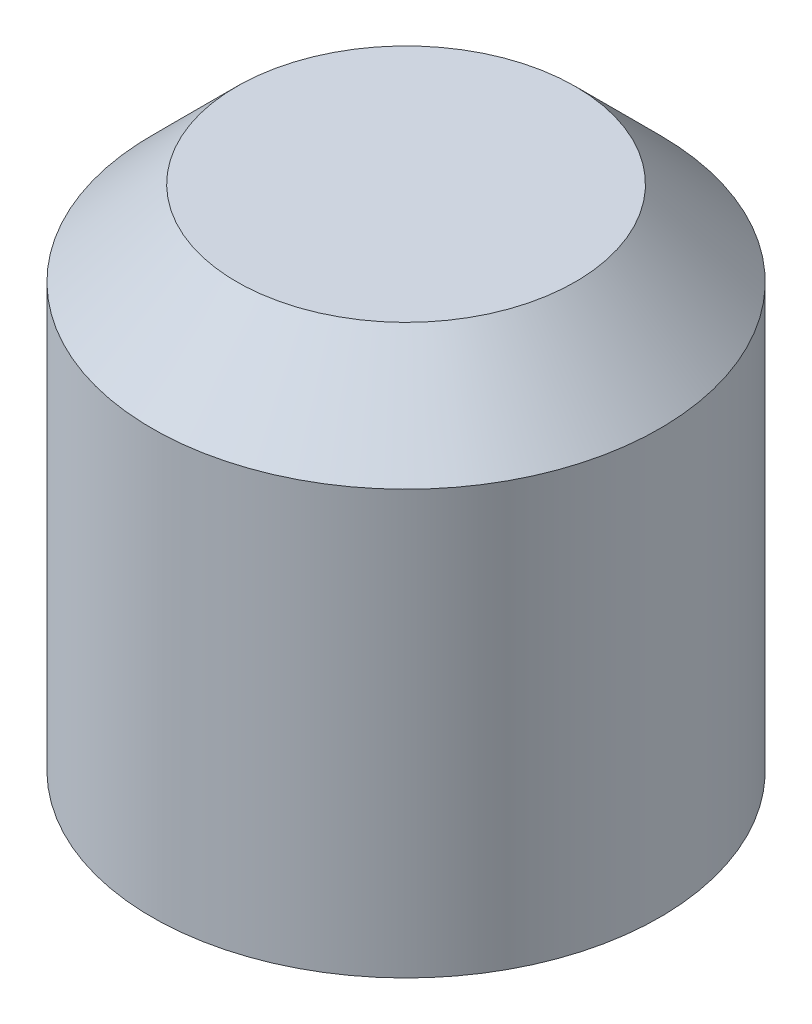
ISO-10303-21;
HEADER;
FILE_DESCRIPTION(('STEP AP214'),'2;1');
FILE_NAME('part.step','',(''),(''),'','','');
FILE_SCHEMA(('AUTOMOTIVE_DESIGN { 1 0 10303 214 1 1 1 1 }'));
ENDSEC;
DATA;
#1=APPLICATION_CONTEXT('core data for automotive mechanical design processes');
#2=APPLICATION_PROTOCOL_DEFINITION('international standard','automotive_design',2000,#1);
#3=PRODUCT_CONTEXT('',#1,'mechanical');
#4=PRODUCT('Part','Part','',(#3));
#5=PRODUCT_RELATED_PRODUCT_CATEGORY('part','',(#4));
#6=PRODUCT_DEFINITION_FORMATION('','',#4);
#7=PRODUCT_DEFINITION_CONTEXT('part definition',#1,'design');
#8=PRODUCT_DEFINITION('design','',#6,#7);
#9=PRODUCT_DEFINITION_SHAPE('','',#8);
#10=(LENGTH_UNIT() NAMED_UNIT(*) SI_UNIT(.MILLI.,.METRE.));
#11=(NAMED_UNIT(*) PLANE_ANGLE_UNIT() SI_UNIT($,.RADIAN.));
#12=(NAMED_UNIT(*) SI_UNIT($,.STERADIAN.) SOLID_ANGLE_UNIT());
#13=UNCERTAINTY_MEASURE_WITH_UNIT(LENGTH_MEASURE(1.E-05),#10,'distance_accuracy_value','');
#14=(GEOMETRIC_REPRESENTATION_CONTEXT(3) GLOBAL_UNCERTAINTY_ASSIGNED_CONTEXT((#13)) GLOBAL_UNIT_ASSIGNED_CONTEXT((#10,
#11,#12)) REPRESENTATION_CONTEXT('',''));
#15=CARTESIAN_POINT('',(0.,0.,0.));
#16=DIRECTION('',(0.,0.,1.));
#17=DIRECTION('',(1.,0.,0.));
#18=AXIS2_PLACEMENT_3D('',#15,#16,#17);
#19=CARTESIAN_POINT('',(-1.15470053837925,2.,0.));
#20=DIRECTION('',(-0.866025403784439,0.,-0.5));
#21=DIRECTION('',(-0.5,0.,0.866025403784439));
#22=AXIS2_PLACEMENT_3D('',#19,#20,#21);
#23=PLANE('',#22);
#24=DIRECTION('',(0.,1.,0.));
#25=VECTOR('',#24,1.);
#26=CARTESIAN_POINT('',(-0.577350269189626,2.,-1.));
#27=LINE('',#26,#25);
#28=CARTESIAN_POINT('',(-0.577350269189626,0.,-1.));
#29=VERTEX_POINT('',#28);
#30=CARTESIAN_POINT('',(-0.577350269189626,2.,-1.));
#31=VERTEX_POINT('',#30);
#32=EDGE_CURVE('E81',#29,#31,#27,.T.);
#33=ORIENTED_EDGE('',*,*,#32,.T.);
#34=DIRECTION('',(-0.5,0.,0.866025403784439));
#35=VECTOR('',#34,1.);
#36=CARTESIAN_POINT('',(-1.15470053837925,2.,0.));
#37=LINE('',#36,#35);
#38=CARTESIAN_POINT('',(-1.15470053837925,2.,0.));
#39=VERTEX_POINT('',#38);
#40=EDGE_CURVE('E70',#39,#31,#37,.F.);
#41=ORIENTED_EDGE('',*,*,#40,.F.);
#42=DIRECTION('',(0.,1.,0.));
#43=VECTOR('',#42,1.);
#44=CARTESIAN_POINT('',(-1.15470053837925,2.,0.));
#45=LINE('',#44,#43);
#46=CARTESIAN_POINT('',(-1.15470053837925,0.,0.));
#47=VERTEX_POINT('',#46);
#48=EDGE_CURVE('E89',#39,#47,#45,.F.);
#49=ORIENTED_EDGE('',*,*,#48,.T.);
#50=DIRECTION('',(-0.5,0.,0.866025403784439));
#51=VECTOR('',#50,1.);
#52=CARTESIAN_POINT('',(-1.15470053837925,0.,0.));
#53=LINE('',#52,#51);
#54=EDGE_CURVE('E65',#29,#47,#53,.T.);
#55=ORIENTED_EDGE('',*,*,#54,.F.);
#56=EDGE_LOOP('',(#33,#41,#49,#55));
#57=FACE_BOUND('',#56,.T.);
#58=ADVANCED_FACE('F16',(#57),#23,.F.);
#59=CARTESIAN_POINT('',(-0.577350269189626,2.,-1.));
#60=DIRECTION('',(0.,0.,-1.));
#61=DIRECTION('',(-1.,0.,0.));
#62=AXIS2_PLACEMENT_3D('',#59,#60,#61);
#63=PLANE('',#62);
#64=DIRECTION('',(0.,1.,0.));
#65=VECTOR('',#64,1.);
#66=CARTESIAN_POINT('',(0.577350269189626,2.,-1.));
#67=LINE('',#66,#65);
#68=CARTESIAN_POINT('',(0.577350269189626,0.,-1.));
#69=VERTEX_POINT('',#68);
#70=CARTESIAN_POINT('',(0.577350269189626,2.,-1.));
#71=VERTEX_POINT('',#70);
#72=EDGE_CURVE('E85',#69,#71,#67,.T.);
#73=ORIENTED_EDGE('',*,*,#72,.T.);
#74=DIRECTION('',(-1.,0.,0.));
#75=VECTOR('',#74,1.);
#76=CARTESIAN_POINT('',(-0.577350269189626,2.,-1.));
#77=LINE('',#76,#75);
#78=EDGE_CURVE('E74',#31,#71,#77,.F.);
#79=ORIENTED_EDGE('',*,*,#78,.F.);
#80=ORIENTED_EDGE('',*,*,#32,.F.);
#81=DIRECTION('',(-1.,0.,0.));
#82=VECTOR('',#81,1.);
#83=CARTESIAN_POINT('',(-0.577350269189626,0.,-1.));
#84=LINE('',#83,#82);
#85=EDGE_CURVE('E87',#69,#29,#84,.T.);
#86=ORIENTED_EDGE('',*,*,#85,.F.);
#87=EDGE_LOOP('',(#73,#79,#80,#86));
#88=FACE_BOUND('',#87,.T.);
#89=ADVANCED_FACE('F84',(#88),#63,.F.);
#90=CARTESIAN_POINT('',(-0.577350269189626,2.,1.));
#91=DIRECTION('',(-0.866025403784439,0.,0.5));
#92=DIRECTION('',(0.5,0.,0.866025403784439));
#93=AXIS2_PLACEMENT_3D('',#90,#91,#92);
#94=PLANE('',#93);
#95=ORIENTED_EDGE('',*,*,#48,.F.);
#96=DIRECTION('',(-0.5,0.,-0.866025403784439));
#97=VECTOR('',#96,1.);
#98=CARTESIAN_POINT('',(-0.577350269189626,2.,1.));
#99=LINE('',#98,#97);
#100=CARTESIAN_POINT('',(-0.577350269189626,2.,1.));
#101=VERTEX_POINT('',#100);
#102=EDGE_CURVE('E77',#101,#39,#99,.T.);
#103=ORIENTED_EDGE('',*,*,#102,.F.);
#104=DIRECTION('',(0.,1.,0.));
#105=VECTOR('',#104,1.);
#106=CARTESIAN_POINT('',(-0.577350269189626,2.,1.));
#107=LINE('',#106,#105);
#108=CARTESIAN_POINT('',(-0.577350269189626,0.,1.));
#109=VERTEX_POINT('',#108);
#110=EDGE_CURVE('E101',#101,#109,#107,.F.);
#111=ORIENTED_EDGE('',*,*,#110,.T.);
#112=DIRECTION('',(0.5,0.,0.866025403784439));
#113=VECTOR('',#112,1.);
#114=CARTESIAN_POINT('',(-0.577350269189626,0.,1.));
#115=LINE('',#114,#113);
#116=EDGE_CURVE('E96',#47,#109,#115,.T.);
#117=ORIENTED_EDGE('',*,*,#116,.F.);
#118=EDGE_LOOP('',(#95,#103,#111,#117));
#119=FACE_BOUND('',#118,.T.);
#120=ADVANCED_FACE('F99',(#119),#94,.F.);
#121=CARTESIAN_POINT('',(0.577350269189626,2.,-1.));
#122=DIRECTION('',(0.866025403784439,0.,-0.5));
#123=DIRECTION('',(-0.5,0.,-0.866025403784439));
#124=AXIS2_PLACEMENT_3D('',#121,#122,#123);
#125=PLANE('',#124);
#126=DIRECTION('',(0.,1.,0.));
#127=VECTOR('',#126,1.);
#128=CARTESIAN_POINT('',(1.15470053837925,2.,0.));
#129=LINE('',#128,#127);
#130=CARTESIAN_POINT('',(1.15470053837925,0.,0.));
#131=VERTEX_POINT('',#130);
#132=CARTESIAN_POINT('',(1.15470053837925,2.,0.));
#133=VERTEX_POINT('',#132);
#134=EDGE_CURVE('E115',#131,#133,#129,.T.);
#135=ORIENTED_EDGE('',*,*,#134,.T.);
#136=DIRECTION('',(0.5,0.,0.866025403784438));
#137=VECTOR('',#136,1.);
#138=CARTESIAN_POINT('',(0.577350269189626,2.,-1.));
#139=LINE('',#138,#137);
#140=EDGE_CURVE('E107',#71,#133,#139,.T.);
#141=ORIENTED_EDGE('',*,*,#140,.F.);
#142=ORIENTED_EDGE('',*,*,#72,.F.);
#143=DIRECTION('',(-0.5,0.,-0.866025403784439));
#144=VECTOR('',#143,1.);
#145=CARTESIAN_POINT('',(0.577350269189626,0.,-1.));
#146=LINE('',#145,#144);
#147=EDGE_CURVE('E33',#131,#69,#146,.T.);
#148=ORIENTED_EDGE('',*,*,#147,.F.);
#149=EDGE_LOOP('',(#135,#141,#142,#148));
#150=FACE_BOUND('',#149,.T.);
#151=ADVANCED_FACE('F205',(#150),#125,.F.);
#152=CARTESIAN_POINT('',(0.,2.,0.));
#153=DIRECTION('',(0.,-1.,0.));
#154=DIRECTION('',(0.,0.,-1.));
#155=AXIS2_PLACEMENT_3D('',#152,#153,#154);
#156=PLANE('',#155);
#157=ORIENTED_EDGE('',*,*,#40,.T.);
#158=ORIENTED_EDGE('',*,*,#78,.T.);
#159=ORIENTED_EDGE('',*,*,#140,.T.);
#160=DIRECTION('',(0.5,0.,-0.866025403784439));
#161=VECTOR('',#160,1.);
#162=CARTESIAN_POINT('',(1.15470053837925,2.,0.));
#163=LINE('',#162,#161);
#164=CARTESIAN_POINT('',(0.577350269189626,2.,1.));
#165=VERTEX_POINT('',#164);
#166=EDGE_CURVE('E117',#133,#165,#163,.F.);
#167=ORIENTED_EDGE('',*,*,#166,.T.);
#168=DIRECTION('',(1.,0.,0.));
#169=VECTOR('',#168,1.);
#170=CARTESIAN_POINT('',(0.577350269189626,2.,1.));
#171=LINE('',#170,#169);
#172=EDGE_CURVE('E110',#165,#101,#171,.F.);
#173=ORIENTED_EDGE('',*,*,#172,.T.);
#174=ORIENTED_EDGE('',*,*,#102,.T.);
#175=EDGE_LOOP('',(#157,#158,#159,#167,#173,#174));
#176=FACE_BOUND('',#175,.T.);
#177=ADVANCED_FACE('F71',(#176),#156,.T.);
#178=CARTESIAN_POINT('',(0.577350269189626,2.,1.));
#179=DIRECTION('',(0.,0.,1.));
#180=DIRECTION('',(1.,0.,0.));
#181=AXIS2_PLACEMENT_3D('',#178,#179,#180);
#182=PLANE('',#181);
#183=ORIENTED_EDGE('',*,*,#110,.F.);
#184=ORIENTED_EDGE('',*,*,#172,.F.);
#185=DIRECTION('',(0.,1.,0.));
#186=VECTOR('',#185,1.);
#187=CARTESIAN_POINT('',(0.577350269189625,2.,1.));
#188=LINE('',#187,#186);
#189=CARTESIAN_POINT('',(0.577350269189626,0.,1.));
#190=VERTEX_POINT('',#189);
#191=EDGE_CURVE('E119',#165,#190,#188,.F.);
#192=ORIENTED_EDGE('',*,*,#191,.T.);
#193=DIRECTION('',(1.,0.,0.));
#194=VECTOR('',#193,1.);
#195=CARTESIAN_POINT('',(0.577350269189626,0.,1.));
#196=LINE('',#195,#194);
#197=EDGE_CURVE('E113',#109,#190,#196,.T.);
#198=ORIENTED_EDGE('',*,*,#197,.F.);
#199=EDGE_LOOP('',(#183,#184,#192,#198));
#200=FACE_BOUND('',#199,.T.);
#201=ADVANCED_FACE('F137',(#200),#182,.F.);
#202=CARTESIAN_POINT('',(0.,3.,0.));
#203=DIRECTION('',(0.,1.,0.));
#204=DIRECTION('',(0.,0.,1.));
#205=AXIS2_PLACEMENT_3D('',#202,#203,#204);
#206=PLANE('',#205);
#207=CARTESIAN_POINT('',(0.,2.9999999999859,0.));
#208=DIRECTION('',(0.,-1.,0.));
#209=DIRECTION('',(0.,0.,-1.));
#210=AXIS2_PLACEMENT_3D('',#207,#208,#209);
#211=CIRCLE('',#210,0.99999999991951);
#212=CARTESIAN_POINT('',(0.,2.9999999999859,-0.99999999991951));
#213=VERTEX_POINT('',#212);
#214=EDGE_CURVE('E19',#213,#213,#211,.T.);
#215=ORIENTED_EDGE('',*,*,#214,.F.);
#216=EDGE_LOOP('',(#215));
#217=FACE_BOUND('',#216,.T.);
#218=ADVANCED_FACE('F134',(#217),#206,.T.);
#219=CARTESIAN_POINT('',(1.15470053837925,2.,0.));
#220=DIRECTION('',(0.866025403784439,0.,0.5));
#221=DIRECTION('',(0.5,0.,-0.866025403784439));
#222=AXIS2_PLACEMENT_3D('',#219,#220,#221);
#223=PLANE('',#222);
#224=ORIENTED_EDGE('',*,*,#191,.F.);
#225=ORIENTED_EDGE('',*,*,#166,.F.);
#226=ORIENTED_EDGE('',*,*,#134,.F.);
#227=DIRECTION('',(-0.5,0.,0.866025403784438));
#228=VECTOR('',#227,1.);
#229=CARTESIAN_POINT('',(1.15470053837925,0.,0.));
#230=LINE('',#229,#228);
#231=EDGE_CURVE('E124',#131,#190,#230,.T.);
#232=ORIENTED_EDGE('',*,*,#231,.T.);
#233=EDGE_LOOP('',(#224,#225,#226,#232));
#234=FACE_BOUND('',#233,.T.);
#235=ADVANCED_FACE('F136',(#234),#223,.F.);
#236=CARTESIAN_POINT('',(0.,2.49999999999773,0.));
#237=DIRECTION('',(0.,-1.,0.));
#238=DIRECTION('',(0.,0.,-1.));
#239=AXIS2_PLACEMENT_3D('',#236,#237,#238);
#240=CONICAL_SURFACE('',#239,1.49999999996453,0.785398163454292);
#241=CARTESIAN_POINT('',(0.,2.5,0.));
#242=DIRECTION('',(0.,-1.,0.));
#243=DIRECTION('',(0.,0.,-1.));
#244=AXIS2_PLACEMENT_3D('',#241,#242,#243);
#245=CIRCLE('',#244,1.5);
#246=CARTESIAN_POINT('',(0.,2.5,-1.5));
#247=VERTEX_POINT('',#246);
#248=EDGE_CURVE('E25',#247,#247,#245,.T.);
#249=ORIENTED_EDGE('',*,*,#248,.F.);
#250=EDGE_LOOP('',(#249));
#251=FACE_BOUND('',#250,.T.);
#252=ORIENTED_EDGE('',*,*,#214,.T.);
#253=EDGE_LOOP('',(#252));
#254=FACE_BOUND('',#253,.T.);
#255=ADVANCED_FACE('F132',(#251,#254),#240,.T.);
#256=CARTESIAN_POINT('',(0.,0.,0.));
#257=DIRECTION('',(0.,1.,0.));
#258=DIRECTION('',(0.,0.,1.));
#259=AXIS2_PLACEMENT_3D('',#256,#257,#258);
#260=PLANE('',#259);
#261=CARTESIAN_POINT('',(0.,0.,0.));
#262=DIRECTION('',(0.,-1.,0.));
#263=DIRECTION('',(0.,0.,-1.));
#264=AXIS2_PLACEMENT_3D('',#261,#262,#263);
#265=CIRCLE('',#264,1.5);
#266=CARTESIAN_POINT('',(0.,0.,-1.5));
#267=VERTEX_POINT('',#266);
#268=EDGE_CURVE('E11',#267,#267,#265,.F.);
#269=ORIENTED_EDGE('',*,*,#268,.F.);
#270=EDGE_LOOP('',(#269));
#271=FACE_BOUND('',#270,.T.);
#272=ORIENTED_EDGE('',*,*,#147,.T.);
#273=ORIENTED_EDGE('',*,*,#85,.T.);
#274=ORIENTED_EDGE('',*,*,#54,.T.);
#275=ORIENTED_EDGE('',*,*,#116,.T.);
#276=ORIENTED_EDGE('',*,*,#197,.T.);
#277=ORIENTED_EDGE('',*,*,#231,.F.);
#278=EDGE_LOOP('',(#272,#273,#274,#275,#276,#277));
#279=FACE_BOUND('',#278,.T.);
#280=ADVANCED_FACE('F94',(#271,#279),#260,.F.);
#281=CARTESIAN_POINT('',(0.,3.,0.));
#282=DIRECTION('',(0.,-1.,0.));
#283=DIRECTION('',(0.,0.,-1.));
#284=AXIS2_PLACEMENT_3D('',#281,#282,#283);
#285=CYLINDRICAL_SURFACE('',#284,1.5);
#286=ORIENTED_EDGE('',*,*,#268,.T.);
#287=EDGE_LOOP('',(#286));
#288=FACE_BOUND('',#287,.T.);
#289=ORIENTED_EDGE('',*,*,#248,.T.);
#290=EDGE_LOOP('',(#289));
#291=FACE_BOUND('',#290,.T.);
#292=ADVANCED_FACE('F147',(#288,#291),#285,.T.);
#293=CLOSED_SHELL('',(#58,#89,#120,#151,#177,#201,#218,#235,#255,#280,#292));
#294=MANIFOLD_SOLID_BREP('B1',#293);
#295=ADVANCED_BREP_SHAPE_REPRESENTATION('',(#18,#294),#14);
#296=SHAPE_DEFINITION_REPRESENTATION(#9,#295);
ENDSEC;
END-ISO-10303-21;
